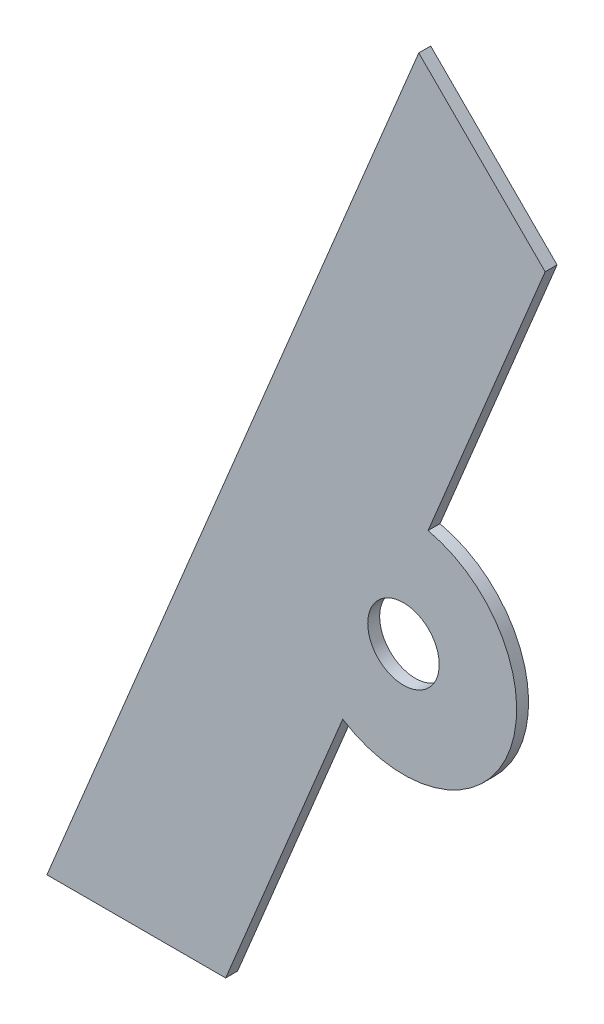
ISO-10303-21;
HEADER;
FILE_DESCRIPTION(('STEP AP214'),'2;1');
FILE_NAME('part.step','',(''),(''),'','','');
FILE_SCHEMA(('AUTOMOTIVE_DESIGN { 1 0 10303 214 1 1 1 1 }'));
ENDSEC;
DATA;
#1=APPLICATION_CONTEXT('core data for automotive mechanical design processes');
#2=APPLICATION_PROTOCOL_DEFINITION('international standard','automotive_design',2000,#1);
#3=PRODUCT_CONTEXT('',#1,'mechanical');
#4=PRODUCT('Part','Part','',(#3));
#5=PRODUCT_RELATED_PRODUCT_CATEGORY('part','',(#4));
#6=PRODUCT_DEFINITION_FORMATION('','',#4);
#7=PRODUCT_DEFINITION_CONTEXT('part definition',#1,'design');
#8=PRODUCT_DEFINITION('design','',#6,#7);
#9=PRODUCT_DEFINITION_SHAPE('','',#8);
#10=(LENGTH_UNIT() NAMED_UNIT(*) SI_UNIT(.MILLI.,.METRE.));
#11=(NAMED_UNIT(*) PLANE_ANGLE_UNIT() SI_UNIT($,.RADIAN.));
#12=(NAMED_UNIT(*) SI_UNIT($,.STERADIAN.) SOLID_ANGLE_UNIT());
#13=UNCERTAINTY_MEASURE_WITH_UNIT(LENGTH_MEASURE(1.E-05),#10,'distance_accuracy_value','');
#14=(GEOMETRIC_REPRESENTATION_CONTEXT(3) GLOBAL_UNCERTAINTY_ASSIGNED_CONTEXT((#13)) GLOBAL_UNIT_ASSIGNED_CONTEXT((#10,
#11,#12)) REPRESENTATION_CONTEXT('',''));
#15=CARTESIAN_POINT('',(0.,0.,0.));
#16=DIRECTION('',(0.,0.,1.));
#17=DIRECTION('',(1.,0.,0.));
#18=AXIS2_PLACEMENT_3D('',#15,#16,#17);
#19=CARTESIAN_POINT('',(26510.1868357487,11835.1721675747,908.));
#20=DIRECTION('',(0.,0.,1.));
#21=DIRECTION('',(1.,0.,0.));
#22=AXIS2_PLACEMENT_3D('',#19,#20,#21);
#23=PLANE('',#22);
#24=CARTESIAN_POINT('',(26524.6738284451,11829.1714587218,908.));
#25=DIRECTION('',(0.,0.,-1.));
#26=DIRECTION('',(-1.,0.,0.));
#27=AXIS2_PLACEMENT_3D('',#24,#25,#26);
#28=CIRCLE('',#27,19.0000000000021);
#29=CARTESIAN_POINT('',(26514.4785851558,11813.1384610523,908.));
#30=VERTEX_POINT('',#29);
#31=CARTESIAN_POINT('',(26528.8017441543,11847.7176257624,908.));
#32=VERTEX_POINT('',#31);
#33=EDGE_CURVE('E111',#30,#32,#28,.F.);
#34=ORIENTED_EDGE('',*,*,#33,.F.);
#35=DIRECTION('',(0.382683432365069,0.923879532511295,0.));
#36=VECTOR('',#35,1.);
#37=CARTESIAN_POINT('',(26514.4785851558,11813.1384610523,908.));
#38=LINE('',#37,#36);
#39=CARTESIAN_POINT('',(26494.8257165078,11765.6922390228,908.));
#40=VERTEX_POINT('',#39);
#41=EDGE_CURVE('E50',#40,#30,#38,.T.);
#42=ORIENTED_EDGE('',*,*,#41,.F.);
#43=DIRECTION('',(1.,0.,0.));
#44=VECTOR('',#43,1.);
#45=CARTESIAN_POINT('',(26494.8257165078,11765.6922390228,908.));
#46=LINE('',#45,#44);
#47=CARTESIAN_POINT('',(26464.8257165079,11765.6922390228,908.));
#48=VERTEX_POINT('',#47);
#49=EDGE_CURVE('E59',#48,#40,#46,.T.);
#50=ORIENTED_EDGE('',*,*,#49,.F.);
#51=DIRECTION('',(-0.382683432365068,-0.923879532511296,0.));
#52=VECTOR('',#51,1.);
#53=CARTESIAN_POINT('',(26464.8257165079,11765.6922390228,908.));
#54=LINE('',#53,#52);
#55=CARTESIAN_POINT('',(26527.2414093666,11916.3770512275,908.));
#56=VERTEX_POINT('',#55);
#57=EDGE_CURVE('E124',#56,#48,#54,.T.);
#58=ORIENTED_EDGE('',*,*,#57,.F.);
#59=DIRECTION('',(-0.707106781186586,0.707106781186509,0.));
#60=VECTOR('',#59,1.);
#61=CARTESIAN_POINT('',(26527.2414093666,11916.3770512275,908.));
#62=LINE('',#61,#60);
#63=CARTESIAN_POINT('',(26548.4546128022,11895.1638477919,908.));
#64=VERTEX_POINT('',#63);
#65=EDGE_CURVE('E84',#64,#56,#62,.T.);
#66=ORIENTED_EDGE('',*,*,#65,.F.);
#67=DIRECTION('',(0.382683432365069,0.923879532511295,0.));
#68=VECTOR('',#67,1.);
#69=CARTESIAN_POINT('',(26548.4546128022,11895.1638477919,908.));
#70=LINE('',#69,#68);
#71=EDGE_CURVE('E81',#32,#64,#70,.T.);
#72=ORIENTED_EDGE('',*,*,#71,.F.);
#73=EDGE_LOOP('',(#34,#42,#50,#58,#66,#72));
#74=FACE_BOUND('',#73,.T.);
#75=CARTESIAN_POINT('',(26524.6738284451,11829.1714587218,908.));
#76=DIRECTION('',(0.,0.,-1.));
#77=DIRECTION('',(-1.,0.,0.));
#78=AXIS2_PLACEMENT_3D('',#75,#76,#77);
#79=CIRCLE('',#78,6.);
#80=CARTESIAN_POINT('',(26518.6738284451,11829.1714587218,908.));
#81=VERTEX_POINT('',#80);
#82=EDGE_CURVE('E19',#81,#81,#79,.F.);
#83=ORIENTED_EDGE('',*,*,#82,.T.);
#84=EDGE_LOOP('',(#83));
#85=FACE_BOUND('',#84,.T.);
#86=ADVANCED_FACE('F16',(#74,#85),#23,.F.);
#87=CARTESIAN_POINT('',(26524.6738284451,11829.1714587218,910.));
#88=DIRECTION('',(0.,0.,-1.));
#89=DIRECTION('',(-1.,0.,0.));
#90=AXIS2_PLACEMENT_3D('',#87,#88,#89);
#91=CYLINDRICAL_SURFACE('',#90,6.);
#92=ORIENTED_EDGE('',*,*,#82,.F.);
#93=EDGE_LOOP('',(#92));
#94=FACE_BOUND('',#93,.T.);
#95=CARTESIAN_POINT('',(26524.6738284451,11829.1714587218,910.));
#96=DIRECTION('',(0.,0.,-1.));
#97=DIRECTION('',(-1.,0.,0.));
#98=AXIS2_PLACEMENT_3D('',#95,#96,#97);
#99=CIRCLE('',#98,6.);
#100=CARTESIAN_POINT('',(26518.6738284451,11829.1714587218,910.));
#101=VERTEX_POINT('',#100);
#102=EDGE_CURVE('E99',#101,#101,#99,.T.);
#103=ORIENTED_EDGE('',*,*,#102,.F.);
#104=EDGE_LOOP('',(#103));
#105=FACE_BOUND('',#104,.T.);
#106=ADVANCED_FACE('F219',(#94,#105),#91,.F.);
#107=CARTESIAN_POINT('',(26548.4546128022,11895.1638477919,910.));
#108=DIRECTION('',(0.923879532511295,-0.382683432365069,0.));
#109=DIRECTION('',(0.382683432365069,0.923879532511295,0.));
#110=AXIS2_PLACEMENT_3D('',#107,#108,#109);
#111=PLANE('',#110);
#112=ORIENTED_EDGE('',*,*,#71,.T.);
#113=DIRECTION('',(0.,0.,1.));
#114=VECTOR('',#113,1.);
#115=CARTESIAN_POINT('',(26548.4546128022,11895.1638477919,910.));
#116=LINE('',#115,#114);
#117=CARTESIAN_POINT('',(26548.4546128022,11895.1638477919,910.));
#118=VERTEX_POINT('',#117);
#119=EDGE_CURVE('E74',#118,#64,#116,.F.);
#120=ORIENTED_EDGE('',*,*,#119,.F.);
#121=DIRECTION('',(0.382683432365023,0.923879532511314,0.));
#122=VECTOR('',#121,1.);
#123=CARTESIAN_POINT('',(26528.8017441543,11847.7176257624,910.));
#124=LINE('',#123,#122);
#125=CARTESIAN_POINT('',(26528.8017441543,11847.7176257624,910.));
#126=VERTEX_POINT('',#125);
#127=EDGE_CURVE('E79',#126,#118,#124,.T.);
#128=ORIENTED_EDGE('',*,*,#127,.F.);
#129=DIRECTION('',(0.,0.,-1.));
#130=VECTOR('',#129,1.);
#131=CARTESIAN_POINT('',(26528.8017441543,11847.7176257624,910.));
#132=LINE('',#131,#130);
#133=EDGE_CURVE('E102',#32,#126,#132,.F.);
#134=ORIENTED_EDGE('',*,*,#133,.F.);
#135=EDGE_LOOP('',(#112,#120,#128,#134));
#136=FACE_BOUND('',#135,.T.);
#137=ADVANCED_FACE('F76',(#136),#111,.T.);
#138=CARTESIAN_POINT('',(26527.2414093666,11916.3770512275,910.));
#139=DIRECTION('',(0.707106781186509,0.707106781186586,0.));
#140=DIRECTION('',(-0.707106781186586,0.707106781186509,0.));
#141=AXIS2_PLACEMENT_3D('',#138,#139,#140);
#142=PLANE('',#141);
#143=ORIENTED_EDGE('',*,*,#65,.T.);
#144=DIRECTION('',(0.,0.,1.));
#145=VECTOR('',#144,1.);
#146=CARTESIAN_POINT('',(26527.2414093666,11916.3770512275,910.));
#147=LINE('',#146,#145);
#148=CARTESIAN_POINT('',(26527.2414093666,11916.3770512275,910.));
#149=VERTEX_POINT('',#148);
#150=EDGE_CURVE('E90',#149,#56,#147,.F.);
#151=ORIENTED_EDGE('',*,*,#150,.F.);
#152=DIRECTION('',(-0.707106781186547,0.707106781186547,0.));
#153=VECTOR('',#152,1.);
#154=CARTESIAN_POINT('',(26548.4546128022,11895.1638477919,910.));
#155=LINE('',#154,#153);
#156=EDGE_CURVE('E87',#118,#149,#155,.T.);
#157=ORIENTED_EDGE('',*,*,#156,.F.);
#158=ORIENTED_EDGE('',*,*,#119,.T.);
#159=EDGE_LOOP('',(#143,#151,#157,#158));
#160=FACE_BOUND('',#159,.T.);
#161=ADVANCED_FACE('F88',(#160),#142,.T.);
#162=CARTESIAN_POINT('',(26464.8257165079,11765.6922390228,910.));
#163=DIRECTION('',(-0.923879532511296,0.382683432365068,0.));
#164=DIRECTION('',(-0.382683432365068,-0.923879532511296,0.));
#165=AXIS2_PLACEMENT_3D('',#162,#163,#164);
#166=PLANE('',#165);
#167=ORIENTED_EDGE('',*,*,#57,.T.);
#168=DIRECTION('',(0.,0.,1.));
#169=VECTOR('',#168,1.);
#170=CARTESIAN_POINT('',(26464.8257165079,11765.6922390228,910.));
#171=LINE('',#170,#169);
#172=CARTESIAN_POINT('',(26464.8257165079,11765.6922390228,910.));
#173=VERTEX_POINT('',#172);
#174=EDGE_CURVE('E122',#173,#48,#171,.F.);
#175=ORIENTED_EDGE('',*,*,#174,.F.);
#176=DIRECTION('',(-0.382683432365072,-0.923879532511294,0.));
#177=VECTOR('',#176,1.);
#178=CARTESIAN_POINT('',(26527.2414093666,11916.3770512275,910.));
#179=LINE('',#178,#177);
#180=EDGE_CURVE('E94',#149,#173,#179,.T.);
#181=ORIENTED_EDGE('',*,*,#180,.F.);
#182=ORIENTED_EDGE('',*,*,#150,.T.);
#183=EDGE_LOOP('',(#167,#175,#181,#182));
#184=FACE_BOUND('',#183,.T.);
#185=ADVANCED_FACE('F158',(#184),#166,.T.);
#186=CARTESIAN_POINT('',(26494.8257165078,11765.6922390228,910.));
#187=DIRECTION('',(0.,-1.,0.));
#188=DIRECTION('',(1.,0.,0.));
#189=AXIS2_PLACEMENT_3D('',#186,#187,#188);
#190=PLANE('',#189);
#191=ORIENTED_EDGE('',*,*,#49,.T.);
#192=DIRECTION('',(0.,0.,1.));
#193=VECTOR('',#192,1.);
#194=CARTESIAN_POINT('',(26494.8257165079,11765.6922390228,910.));
#195=LINE('',#194,#193);
#196=CARTESIAN_POINT('',(26494.8257165078,11765.6922390228,910.));
#197=VERTEX_POINT('',#196);
#198=EDGE_CURVE('E113',#197,#40,#195,.F.);
#199=ORIENTED_EDGE('',*,*,#198,.F.);
#200=DIRECTION('',(1.,0.,0.));
#201=VECTOR('',#200,1.);
#202=CARTESIAN_POINT('',(26510.1868357487,11765.6922390228,910.));
#203=LINE('',#202,#201);
#204=EDGE_CURVE('E117',#173,#197,#203,.T.);
#205=ORIENTED_EDGE('',*,*,#204,.F.);
#206=ORIENTED_EDGE('',*,*,#174,.T.);
#207=EDGE_LOOP('',(#191,#199,#205,#206));
#208=FACE_BOUND('',#207,.T.);
#209=ADVANCED_FACE('F160',(#208),#190,.T.);
#210=CARTESIAN_POINT('',(26514.4785851558,11813.1384610523,910.));
#211=DIRECTION('',(0.923879532511295,-0.382683432365069,0.));
#212=DIRECTION('',(0.382683432365069,0.923879532511295,0.));
#213=AXIS2_PLACEMENT_3D('',#210,#211,#212);
#214=PLANE('',#213);
#215=ORIENTED_EDGE('',*,*,#41,.T.);
#216=DIRECTION('',(0.,0.,-1.));
#217=VECTOR('',#216,1.);
#218=CARTESIAN_POINT('',(26514.4785851558,11813.1384610523,910.));
#219=LINE('',#218,#217);
#220=CARTESIAN_POINT('',(26514.4785851558,11813.1384610523,910.));
#221=VERTEX_POINT('',#220);
#222=EDGE_CURVE('E34',#221,#30,#219,.T.);
#223=ORIENTED_EDGE('',*,*,#222,.F.);
#224=DIRECTION('',(0.382683432365141,0.923879532511266,0.));
#225=VECTOR('',#224,1.);
#226=CARTESIAN_POINT('',(26494.8257165078,11765.6922390228,910.));
#227=LINE('',#226,#225);
#228=EDGE_CURVE('E25',#197,#221,#227,.T.);
#229=ORIENTED_EDGE('',*,*,#228,.F.);
#230=ORIENTED_EDGE('',*,*,#198,.T.);
#231=EDGE_LOOP('',(#215,#223,#229,#230));
#232=FACE_BOUND('',#231,.T.);
#233=ADVANCED_FACE('F161',(#232),#214,.T.);
#234=CARTESIAN_POINT('',(26524.6738284451,11829.1714587218,910.));
#235=DIRECTION('',(0.,0.,-1.));
#236=DIRECTION('',(-1.,0.,0.));
#237=AXIS2_PLACEMENT_3D('',#234,#235,#236);
#238=CYLINDRICAL_SURFACE('',#237,19.0000000000021);
#239=ORIENTED_EDGE('',*,*,#33,.T.);
#240=ORIENTED_EDGE('',*,*,#133,.T.);
#241=CARTESIAN_POINT('',(26524.6738284451,11829.1714587218,910.));
#242=DIRECTION('',(0.,0.,-1.));
#243=DIRECTION('',(-1.,0.,0.));
#244=AXIS2_PLACEMENT_3D('',#241,#242,#243);
#245=CIRCLE('',#244,19.0000000000021);
#246=EDGE_CURVE('E10',#221,#126,#245,.F.);
#247=ORIENTED_EDGE('',*,*,#246,.F.);
#248=ORIENTED_EDGE('',*,*,#222,.T.);
#249=EDGE_LOOP('',(#239,#240,#247,#248));
#250=FACE_BOUND('',#249,.T.);
#251=ADVANCED_FACE('F153',(#250),#238,.T.);
#252=CARTESIAN_POINT('',(26510.1868357487,11835.1721675747,910.));
#253=DIRECTION('',(0.,0.,1.));
#254=DIRECTION('',(1.,0.,0.));
#255=AXIS2_PLACEMENT_3D('',#252,#253,#254);
#256=PLANE('',#255);
#257=ORIENTED_EDGE('',*,*,#228,.T.);
#258=ORIENTED_EDGE('',*,*,#246,.T.);
#259=ORIENTED_EDGE('',*,*,#127,.T.);
#260=ORIENTED_EDGE('',*,*,#156,.T.);
#261=ORIENTED_EDGE('',*,*,#180,.T.);
#262=ORIENTED_EDGE('',*,*,#204,.T.);
#263=EDGE_LOOP('',(#257,#258,#259,#260,#261,#262));
#264=FACE_BOUND('',#263,.T.);
#265=ORIENTED_EDGE('',*,*,#102,.T.);
#266=EDGE_LOOP('',(#265));
#267=FACE_BOUND('',#266,.T.);
#268=ADVANCED_FACE('F97',(#264,#267),#256,.T.);
#269=CLOSED_SHELL('',(#86,#106,#137,#161,#185,#209,#233,#251,#268));
#270=MANIFOLD_SOLID_BREP('B1',#269);
#271=ADVANCED_BREP_SHAPE_REPRESENTATION('',(#18,#270),#14);
#272=SHAPE_DEFINITION_REPRESENTATION(#9,#271);
ENDSEC;
END-ISO-10303-21;
